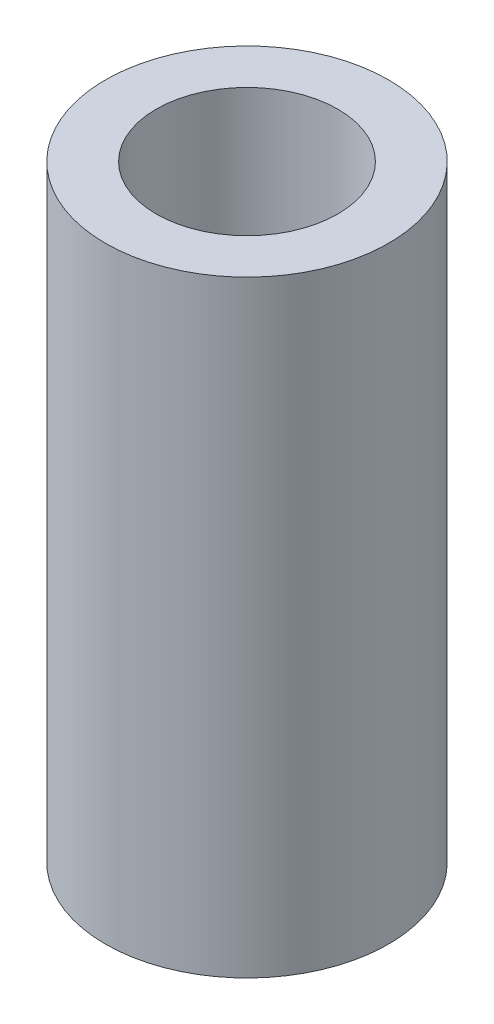
ISO-10303-21;
HEADER;
FILE_DESCRIPTION(('STEP AP214'),'2;1');
FILE_NAME('part.step','',(''),(''),'','','');
FILE_SCHEMA(('AUTOMOTIVE_DESIGN { 1 0 10303 214 1 1 1 1 }'));
ENDSEC;
DATA;
#1=APPLICATION_CONTEXT('core data for automotive mechanical design processes');
#2=APPLICATION_PROTOCOL_DEFINITION('international standard','automotive_design',2000,#1);
#3=PRODUCT_CONTEXT('',#1,'mechanical');
#4=PRODUCT('Part','Part','',(#3));
#5=PRODUCT_RELATED_PRODUCT_CATEGORY('part','',(#4));
#6=PRODUCT_DEFINITION_FORMATION('','',#4);
#7=PRODUCT_DEFINITION_CONTEXT('part definition',#1,'design');
#8=PRODUCT_DEFINITION('design','',#6,#7);
#9=PRODUCT_DEFINITION_SHAPE('','',#8);
#10=(LENGTH_UNIT() NAMED_UNIT(*) SI_UNIT(.MILLI.,.METRE.));
#11=(NAMED_UNIT(*) PLANE_ANGLE_UNIT() SI_UNIT($,.RADIAN.));
#12=(NAMED_UNIT(*) SI_UNIT($,.STERADIAN.) SOLID_ANGLE_UNIT());
#13=UNCERTAINTY_MEASURE_WITH_UNIT(LENGTH_MEASURE(1.E-05),#10,'distance_accuracy_value','');
#14=(GEOMETRIC_REPRESENTATION_CONTEXT(3) GLOBAL_UNCERTAINTY_ASSIGNED_CONTEXT((#13)) GLOBAL_UNIT_ASSIGNED_CONTEXT((#10,
#11,#12)) REPRESENTATION_CONTEXT('',''));
#15=CARTESIAN_POINT('',(0.,0.,0.));
#16=DIRECTION('',(0.,0.,1.));
#17=DIRECTION('',(1.,0.,0.));
#18=AXIS2_PLACEMENT_3D('',#15,#16,#17);
#19=CARTESIAN_POINT('',(0.,32.1558439408876,0.));
#20=DIRECTION('',(0.,-1.,0.));
#21=DIRECTION('',(0.,0.,-1.));
#22=AXIS2_PLACEMENT_3D('',#19,#20,#21);
#23=CYLINDRICAL_SURFACE('',#22,7.5);
#24=CARTESIAN_POINT('',(0.,32.1558439408876,0.));
#25=DIRECTION('',(0.,1.,0.));
#26=DIRECTION('',(0.,0.,1.));
#27=AXIS2_PLACEMENT_3D('',#24,#25,#26);
#28=CIRCLE('',#27,7.5);
#29=CARTESIAN_POINT('',(0.,32.1558439408876,7.5));
#30=VERTEX_POINT('',#29);
#31=EDGE_CURVE('E10',#30,#30,#28,.T.);
#32=ORIENTED_EDGE('',*,*,#31,.F.);
#33=EDGE_LOOP('',(#32));
#34=FACE_BOUND('',#33,.T.);
#35=CARTESIAN_POINT('',(0.,0.,0.));
#36=DIRECTION('',(0.,1.,0.));
#37=DIRECTION('',(0.,0.,1.));
#38=AXIS2_PLACEMENT_3D('',#35,#36,#37);
#39=CIRCLE('',#38,7.5);
#40=CARTESIAN_POINT('',(0.,0.,7.5));
#41=VERTEX_POINT('',#40);
#42=EDGE_CURVE('E37',#41,#41,#39,.T.);
#43=ORIENTED_EDGE('',*,*,#42,.T.);
#44=EDGE_LOOP('',(#43));
#45=FACE_BOUND('',#44,.T.);
#46=ADVANCED_FACE('F40',(#34,#45),#23,.T.);
#47=CARTESIAN_POINT('',(0.,32.1558439408876,0.));
#48=DIRECTION('',(0.,1.,0.));
#49=DIRECTION('',(0.,0.,1.));
#50=AXIS2_PLACEMENT_3D('',#47,#48,#49);
#51=PLANE('',#50);
#52=CARTESIAN_POINT('',(0.,32.1558439408876,0.));
#53=DIRECTION('',(0.,1.,0.));
#54=DIRECTION('',(0.,0.,1.));
#55=AXIS2_PLACEMENT_3D('',#52,#53,#54);
#56=CIRCLE('',#55,4.81221820699992);
#57=CARTESIAN_POINT('',(0.,32.1558439408876,4.81221820699992));
#58=VERTEX_POINT('',#57);
#59=EDGE_CURVE('E50',#58,#58,#56,.T.);
#60=ORIENTED_EDGE('',*,*,#59,.F.);
#61=EDGE_LOOP('',(#60));
#62=FACE_BOUND('',#61,.T.);
#63=ORIENTED_EDGE('',*,*,#31,.T.);
#64=EDGE_LOOP('',(#63));
#65=FACE_BOUND('',#64,.T.);
#66=ADVANCED_FACE('F59',(#62,#65),#51,.T.);
#67=CARTESIAN_POINT('',(0.,0.,0.));
#68=DIRECTION('',(0.,1.,0.));
#69=DIRECTION('',(0.,0.,1.));
#70=AXIS2_PLACEMENT_3D('',#67,#68,#69);
#71=PLANE('',#70);
#72=CARTESIAN_POINT('',(0.,0.,0.));
#73=DIRECTION('',(0.,1.,0.));
#74=DIRECTION('',(0.,0.,1.));
#75=AXIS2_PLACEMENT_3D('',#72,#73,#74);
#76=CIRCLE('',#75,4.81221820699992);
#77=CARTESIAN_POINT('',(0.,0.,4.81221820699992));
#78=VERTEX_POINT('',#77);
#79=EDGE_CURVE('E47',#78,#78,#76,.T.);
#80=ORIENTED_EDGE('',*,*,#79,.T.);
#81=EDGE_LOOP('',(#80));
#82=FACE_BOUND('',#81,.T.);
#83=ORIENTED_EDGE('',*,*,#42,.F.);
#84=EDGE_LOOP('',(#83));
#85=FACE_BOUND('',#84,.T.);
#86=ADVANCED_FACE('F58',(#82,#85),#71,.F.);
#87=CARTESIAN_POINT('',(0.,32.1558439408876,0.));
#88=DIRECTION('',(0.,-1.,0.));
#89=DIRECTION('',(0.,0.,-1.));
#90=AXIS2_PLACEMENT_3D('',#87,#88,#89);
#91=CYLINDRICAL_SURFACE('',#90,4.81221820699992);
#92=ORIENTED_EDGE('',*,*,#59,.T.);
#93=EDGE_LOOP('',(#92));
#94=FACE_BOUND('',#93,.T.);
#95=ORIENTED_EDGE('',*,*,#79,.F.);
#96=EDGE_LOOP('',(#95));
#97=FACE_BOUND('',#96,.T.);
#98=ADVANCED_FACE('F54',(#94,#97),#91,.F.);
#99=CLOSED_SHELL('',(#46,#66,#86,#98));
#100=MANIFOLD_SOLID_BREP('B2',#99);
#101=ADVANCED_BREP_SHAPE_REPRESENTATION('',(#18,#100),#14);
#102=SHAPE_DEFINITION_REPRESENTATION(#9,#101);
ENDSEC;
END-ISO-10303-21;
